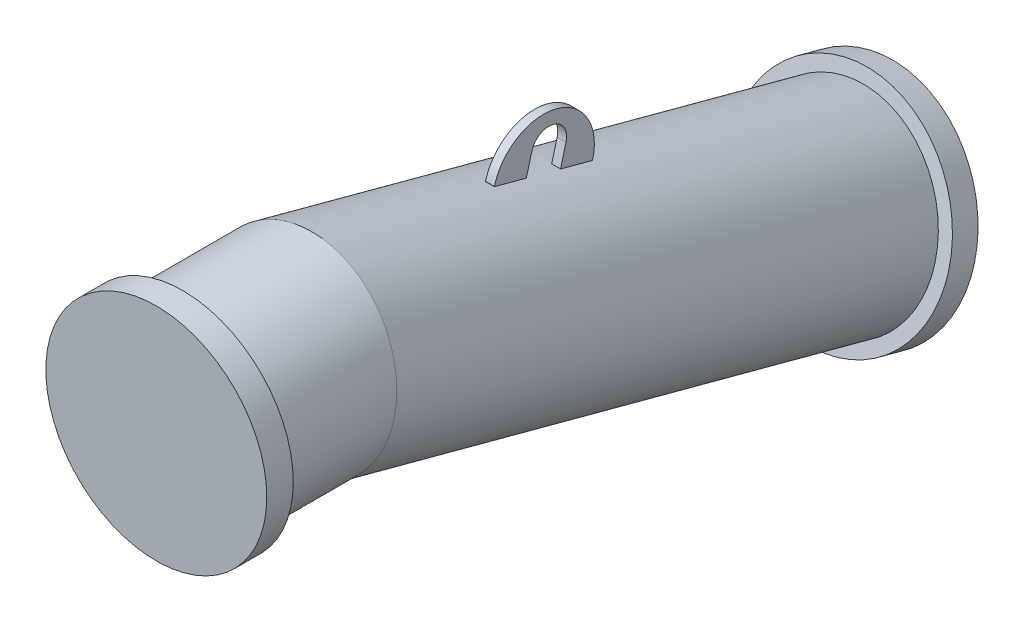
ISO-10303-21;
HEADER;
FILE_DESCRIPTION(('STEP AP214'),'2;1');
FILE_NAME('part.step','',(''),(''),'','','');
FILE_SCHEMA(('AUTOMOTIVE_DESIGN { 1 0 10303 214 1 1 1 1 }'));
ENDSEC;
DATA;
#1=APPLICATION_CONTEXT('core data for automotive mechanical design processes');
#2=APPLICATION_PROTOCOL_DEFINITION('international standard','automotive_design',2000,#1);
#3=PRODUCT_CONTEXT('',#1,'mechanical');
#4=PRODUCT('Part','Part','',(#3));
#5=PRODUCT_RELATED_PRODUCT_CATEGORY('part','',(#4));
#6=PRODUCT_DEFINITION_FORMATION('','',#4);
#7=PRODUCT_DEFINITION_CONTEXT('part definition',#1,'design');
#8=PRODUCT_DEFINITION('design','',#6,#7);
#9=PRODUCT_DEFINITION_SHAPE('','',#8);
#10=(LENGTH_UNIT() NAMED_UNIT(*) SI_UNIT(.MILLI.,.METRE.));
#11=(NAMED_UNIT(*) PLANE_ANGLE_UNIT() SI_UNIT($,.RADIAN.));
#12=(NAMED_UNIT(*) SI_UNIT($,.STERADIAN.) SOLID_ANGLE_UNIT());
#13=UNCERTAINTY_MEASURE_WITH_UNIT(LENGTH_MEASURE(1.E-05),#10,'distance_accuracy_value','');
#14=(GEOMETRIC_REPRESENTATION_CONTEXT(3) GLOBAL_UNCERTAINTY_ASSIGNED_CONTEXT((#13)) GLOBAL_UNIT_ASSIGNED_CONTEXT((#10,
#11,#12)) REPRESENTATION_CONTEXT('',''));
#15=CARTESIAN_POINT('',(0.,0.,0.));
#16=DIRECTION('',(0.,0.,1.));
#17=DIRECTION('',(1.,0.,0.));
#18=AXIS2_PLACEMENT_3D('',#15,#16,#17);
#19=CARTESIAN_POINT('',(5.00000000000018,63.8186386863556,-439.282486778395));
#20=DIRECTION('',(1.,0.,0.));
#21=DIRECTION('',(0.,0.965925826289068,-0.258819045102522));
#22=AXIS2_PLACEMENT_3D('',#19,#20,#21);
#23=PLANE('',#22);
#24=DIRECTION('',(0.,0.965925826289068,-0.258819045102522));
#25=VECTOR('',#24,1.);
#26=CARTESIAN_POINT('',(5.00000000000017,46.3422185990668,-375.071313755839));
#27=LINE('',#26,#25);
#28=CARTESIAN_POINT('',(5.00000000000017,55.4565376035607,-377.513488172653));
#29=VERTEX_POINT('',#28);
#30=CARTESIAN_POINT('',(5.00000000000017,56.0014768619576,-377.659504206864));
#31=VERTEX_POINT('',#30);
#32=EDGE_CURVE('E326',#29,#31,#27,.T.);
#33=ORIENTED_EDGE('',*,*,#32,.F.);
#34=DIRECTION('',(0.,-0.25881904510252,-0.965925826289062));
#35=VECTOR('',#34,1.);
#36=CARTESIAN_POINT('',(5.00000000000017,-23.7026209178614,-672.939489658995));
#37=LINE('',#36,#35);
#38=CARTESIAN_POINT('',(5.00000000000017,45.7508234122149,-413.735706658495));
#39=VERTEX_POINT('',#38);
#40=EDGE_CURVE('E51',#29,#39,#37,.T.);
#41=ORIENTED_EDGE('',*,*,#40,.T.);
#42=DIRECTION('',(0.,0.965925826289069,-0.258819045102522));
#43=VECTOR('',#42,1.);
#44=CARTESIAN_POINT('',(5.00000000000018,46.2957626706128,-413.881722692705));
#45=LINE('',#44,#43);
#46=CARTESIAN_POINT('',(5.00000000000018,68.995019588406,-419.963970252614));
#47=VERTEX_POINT('',#46);
#48=EDGE_CURVE('E333',#39,#47,#45,.T.);
#49=ORIENTED_EDGE('',*,*,#48,.T.);
#50=CARTESIAN_POINT('',(5.00000000000018,63.8186386863556,-439.282486778395));
#51=DIRECTION('',(-1.,0.,0.));
#52=DIRECTION('',(0.,0.965925826289068,-0.258819045102522));
#53=AXIS2_PLACEMENT_3D('',#50,#51,#52);
#54=CIRCLE('',#53,20.);
#55=CARTESIAN_POINT('',(5.00000000000017,58.6422577843051,-458.601003304177));
#56=VERTEX_POINT('',#55);
#57=EDGE_CURVE('E336',#47,#56,#54,.T.);
#58=ORIENTED_EDGE('',*,*,#57,.T.);
#59=DIRECTION('',(0.,-0.965925826289068,0.258819045102521));
#60=VECTOR('',#59,1.);
#61=CARTESIAN_POINT('',(5.00000000000017,35.9430008665119,-452.518755744267));
#62=LINE('',#61,#60);
#63=CARTESIAN_POINT('',(5.00000000000017,35.3980616081141,-452.372739710057));
#64=VERTEX_POINT('',#63);
#65=EDGE_CURVE('E340',#56,#64,#62,.T.);
#66=ORIENTED_EDGE('',*,*,#65,.T.);
#67=CARTESIAN_POINT('',(5.00000000000017,25.6923474167706,-488.594958195896));
#68=VERTEX_POINT('',#67);
#69=EDGE_CURVE('E305',#64,#68,#37,.T.);
#70=ORIENTED_EDGE('',*,*,#69,.T.);
#71=DIRECTION('',(0.,0.965925826289068,-0.258819045102522));
#72=VECTOR('',#71,1.);
#73=CARTESIAN_POINT('',(5.00000000000017,16.5780284122767,-486.152783779082));
#74=LINE('',#73,#72);
#75=CARTESIAN_POINT('',(5.00000000000018,26.2372866751674,-488.740974230107));
#76=VERTEX_POINT('',#75);
#77=EDGE_CURVE('E320',#68,#76,#74,.T.);
#78=ORIENTED_EDGE('',*,*,#77,.T.);
#79=CARTESIAN_POINT('',(5.00000000000017,41.1193817685624,-433.200239218486));
#80=DIRECTION('',(1.,0.,0.));
#81=DIRECTION('',(0.,0.965925826289068,-0.258819045102522));
#82=AXIS2_PLACEMENT_3D('',#79,#80,#81);
#83=CIRCLE('',#82,57.5);
#84=EDGE_CURVE('E343',#76,#31,#83,.T.);
#85=ORIENTED_EDGE('',*,*,#84,.T.);
#86=EDGE_LOOP('',(#33,#41,#49,#58,#66,#70,#78,#85));
#87=FACE_BOUND('',#86,.T.);
#88=ADVANCED_FACE('F17',(#87),#23,.T.);
#89=CARTESIAN_POINT('',(-4.99999999999982,63.8186386863556,-439.282486778395));
#90=DIRECTION('',(1.,0.,0.));
#91=DIRECTION('',(0.,0.965925826289068,-0.258819045102522));
#92=AXIS2_PLACEMENT_3D('',#89,#90,#91);
#93=PLANE('',#92);
#94=DIRECTION('',(0.,-0.25881904510252,-0.965925826289062));
#95=VECTOR('',#94,1.);
#96=CARTESIAN_POINT('',(-4.99999999999983,-23.7026209178614,-672.939489658995));
#97=LINE('',#96,#95);
#98=CARTESIAN_POINT('',(-4.99999999999983,55.4565376035607,-377.513488172653));
#99=VERTEX_POINT('',#98);
#100=CARTESIAN_POINT('',(-4.99999999999983,45.7508234122149,-413.735706658495));
#101=VERTEX_POINT('',#100);
#102=EDGE_CURVE('E306',#99,#101,#97,.T.);
#103=ORIENTED_EDGE('',*,*,#102,.F.);
#104=DIRECTION('',(0.,0.965925826289068,-0.258819045102522));
#105=VECTOR('',#104,1.);
#106=CARTESIAN_POINT('',(-4.99999999999983,46.3422185990668,-375.071313755839));
#107=LINE('',#106,#105);
#108=CARTESIAN_POINT('',(-4.99999999999983,56.0014768619576,-377.659504206864));
#109=VERTEX_POINT('',#108);
#110=EDGE_CURVE('E329',#99,#109,#107,.T.);
#111=ORIENTED_EDGE('',*,*,#110,.T.);
#112=CARTESIAN_POINT('',(-4.99999999999983,41.1193817685624,-433.200239218486));
#113=DIRECTION('',(1.,0.,0.));
#114=DIRECTION('',(0.,0.965925826289068,-0.258819045102522));
#115=AXIS2_PLACEMENT_3D('',#112,#113,#114);
#116=CIRCLE('',#115,57.5);
#117=CARTESIAN_POINT('',(-4.99999999999983,26.2372866751674,-488.740974230108));
#118=VERTEX_POINT('',#117);
#119=EDGE_CURVE('E337',#118,#109,#116,.T.);
#120=ORIENTED_EDGE('',*,*,#119,.F.);
#121=DIRECTION('',(0.,0.965925826289068,-0.258819045102522));
#122=VECTOR('',#121,1.);
#123=CARTESIAN_POINT('',(-4.99999999999983,16.5780284122767,-486.152783779082));
#124=LINE('',#123,#122);
#125=CARTESIAN_POINT('',(-4.99999999999983,25.6923474167706,-488.594958195896));
#126=VERTEX_POINT('',#125);
#127=EDGE_CURVE('E323',#126,#118,#124,.T.);
#128=ORIENTED_EDGE('',*,*,#127,.F.);
#129=CARTESIAN_POINT('',(-4.99999999999984,35.3980616081141,-452.372739710057));
#130=VERTEX_POINT('',#129);
#131=EDGE_CURVE('E290',#130,#126,#97,.T.);
#132=ORIENTED_EDGE('',*,*,#131,.F.);
#133=DIRECTION('',(0.,-0.965925826289068,0.258819045102521));
#134=VECTOR('',#133,1.);
#135=CARTESIAN_POINT('',(-4.99999999999983,35.9430008665119,-452.518755744267));
#136=LINE('',#135,#134);
#137=CARTESIAN_POINT('',(-4.99999999999983,58.6422577843051,-458.601003304177));
#138=VERTEX_POINT('',#137);
#139=EDGE_CURVE('E353',#138,#130,#136,.T.);
#140=ORIENTED_EDGE('',*,*,#139,.F.);
#141=CARTESIAN_POINT('',(-4.99999999999982,63.8186386863556,-439.282486778395));
#142=DIRECTION('',(-1.,0.,0.));
#143=DIRECTION('',(0.,0.965925826289068,-0.258819045102522));
#144=AXIS2_PLACEMENT_3D('',#141,#142,#143);
#145=CIRCLE('',#144,20.);
#146=CARTESIAN_POINT('',(-4.99999999999982,68.995019588406,-419.963970252614));
#147=VERTEX_POINT('',#146);
#148=EDGE_CURVE('E350',#147,#138,#145,.T.);
#149=ORIENTED_EDGE('',*,*,#148,.F.);
#150=DIRECTION('',(0.,0.965925826289069,-0.258819045102522));
#151=VECTOR('',#150,1.);
#152=CARTESIAN_POINT('',(-4.99999999999982,46.2957626706128,-413.881722692705));
#153=LINE('',#152,#151);
#154=EDGE_CURVE('E332',#101,#147,#153,.T.);
#155=ORIENTED_EDGE('',*,*,#154,.F.);
#156=EDGE_LOOP('',(#103,#111,#120,#128,#132,#140,#149,#155));
#157=FACE_BOUND('',#156,.T.);
#158=ADVANCED_FACE('F384',(#157),#93,.F.);
#159=CARTESIAN_POINT('',(5.00000000000018,46.2957626706128,-413.881722692705));
#160=DIRECTION('',(0.,0.258819045102522,0.965925826289069));
#161=DIRECTION('',(0.,-0.965925826289069,0.258819045102522));
#162=AXIS2_PLACEMENT_3D('',#159,#160,#161);
#163=PLANE('',#162);
#164=CARTESIAN_POINT('',(0.,-59.9560782211842,-385.411627731428));
#165=DIRECTION('',(0.,0.258819045102522,0.965925826289069));
#166=DIRECTION('',(0.,-0.965925826289068,0.258819045102522));
#167=AXIS2_PLACEMENT_3D('',#164,#165,#166);
#168=CIRCLE('',#167,109.55);
#169=EDGE_CURVE('E316',#101,#39,#168,.F.);
#170=ORIENTED_EDGE('',*,*,#169,.F.);
#171=ORIENTED_EDGE('',*,*,#154,.T.);
#172=DIRECTION('',(-1.,0.,0.));
#173=VECTOR('',#172,1.);
#174=CARTESIAN_POINT('',(5.00000000000018,68.995019588406,-419.963970252614));
#175=LINE('',#174,#173);
#176=EDGE_CURVE('E27',#47,#147,#175,.T.);
#177=ORIENTED_EDGE('',*,*,#176,.F.);
#178=ORIENTED_EDGE('',*,*,#48,.F.);
#179=EDGE_LOOP('',(#170,#171,#177,#178));
#180=FACE_BOUND('',#179,.T.);
#181=ADVANCED_FACE('F19',(#180),#163,.F.);
#182=CARTESIAN_POINT('',(5.00000000000018,63.8186386863556,-439.282486778395));
#183=DIRECTION('',(-1.,0.,0.));
#184=DIRECTION('',(0.,-0.965925826289068,0.258819045102522));
#185=AXIS2_PLACEMENT_3D('',#182,#183,#184);
#186=CYLINDRICAL_SURFACE('',#185,20.);
#187=ORIENTED_EDGE('',*,*,#148,.T.);
#188=DIRECTION('',(-1.,0.,0.));
#189=VECTOR('',#188,1.);
#190=CARTESIAN_POINT('',(5.00000000000017,58.6422577843051,-458.601003304177));
#191=LINE('',#190,#189);
#192=EDGE_CURVE('E366',#56,#138,#191,.T.);
#193=ORIENTED_EDGE('',*,*,#192,.F.);
#194=ORIENTED_EDGE('',*,*,#57,.F.);
#195=ORIENTED_EDGE('',*,*,#176,.T.);
#196=EDGE_LOOP('',(#187,#193,#194,#195));
#197=FACE_BOUND('',#196,.T.);
#198=ADVANCED_FACE('F377',(#197),#186,.F.);
#199=CARTESIAN_POINT('',(5.00000000000017,35.9430008665119,-452.518755744267));
#200=DIRECTION('',(0.,-0.258819045102521,-0.965925826289068));
#201=DIRECTION('',(0.,0.965925826289068,-0.258819045102521));
#202=AXIS2_PLACEMENT_3D('',#199,#200,#201);
#203=PLANE('',#202);
#204=CARTESIAN_POINT('',(0.,-70.308840025285,-424.04866078299));
#205=DIRECTION('',(0.,-0.258819045102521,-0.965925826289068));
#206=DIRECTION('',(0.,0.965925826289068,-0.258819045102521));
#207=AXIS2_PLACEMENT_3D('',#204,#205,#206);
#208=CIRCLE('',#207,109.55);
#209=EDGE_CURVE('E39',#64,#130,#208,.F.);
#210=ORIENTED_EDGE('',*,*,#209,.F.);
#211=ORIENTED_EDGE('',*,*,#65,.F.);
#212=ORIENTED_EDGE('',*,*,#192,.T.);
#213=ORIENTED_EDGE('',*,*,#139,.T.);
#214=EDGE_LOOP('',(#210,#211,#212,#213));
#215=FACE_BOUND('',#214,.T.);
#216=ADVANCED_FACE('F387',(#215),#203,.F.);
#217=CARTESIAN_POINT('',(5.00000000000017,41.1193817685624,-433.200239218486));
#218=DIRECTION('',(-1.,0.,0.));
#219=DIRECTION('',(0.,-0.965925826289068,0.258819045102522));
#220=AXIS2_PLACEMENT_3D('',#217,#218,#219);
#221=CYLINDRICAL_SURFACE('',#220,57.5);
#222=ORIENTED_EDGE('',*,*,#119,.T.);
#223=DIRECTION('',(-1.,0.,0.));
#224=VECTOR('',#223,1.);
#225=CARTESIAN_POINT('',(5.00000000000017,56.0014768619576,-377.659504206864));
#226=LINE('',#225,#224);
#227=EDGE_CURVE('E347',#31,#109,#226,.T.);
#228=ORIENTED_EDGE('',*,*,#227,.F.);
#229=ORIENTED_EDGE('',*,*,#84,.F.);
#230=DIRECTION('',(-1.,0.,0.));
#231=VECTOR('',#230,1.);
#232=CARTESIAN_POINT('',(5.00000000000018,26.2372866751674,-488.740974230107));
#233=LINE('',#232,#231);
#234=EDGE_CURVE('E362',#76,#118,#233,.T.);
#235=ORIENTED_EDGE('',*,*,#234,.T.);
#236=EDGE_LOOP('',(#222,#228,#229,#235));
#237=FACE_BOUND('',#236,.T.);
#238=ADVANCED_FACE('F483',(#237),#221,.T.);
#239=CARTESIAN_POINT('',(5.00000000000017,46.3422185990668,-375.071313755839));
#240=DIRECTION('',(0.,-0.258819045102522,-0.965925826289068));
#241=DIRECTION('',(0.,0.965925826289068,-0.258819045102522));
#242=AXIS2_PLACEMENT_3D('',#239,#240,#241);
#243=PLANE('',#242);
#244=CARTESIAN_POINT('',(0.,-50.2503640298395,-349.189409245587));
#245=DIRECTION('',(0.,-0.258819045102522,-0.965925826289068));
#246=DIRECTION('',(0.,0.965925826289068,-0.258819045102522));
#247=AXIS2_PLACEMENT_3D('',#244,#245,#246);
#248=CIRCLE('',#247,109.55);
#249=EDGE_CURVE('E312',#29,#99,#248,.F.);
#250=ORIENTED_EDGE('',*,*,#249,.F.);
#251=ORIENTED_EDGE('',*,*,#32,.T.);
#252=ORIENTED_EDGE('',*,*,#227,.T.);
#253=ORIENTED_EDGE('',*,*,#110,.F.);
#254=EDGE_LOOP('',(#250,#251,#252,#253));
#255=FACE_BOUND('',#254,.T.);
#256=ADVANCED_FACE('F499',(#255),#243,.F.);
#257=CARTESIAN_POINT('',(-4.99999999999983,16.5780284122767,-486.152783779082));
#258=DIRECTION('',(0.,0.258819045102522,0.965925826289068));
#259=DIRECTION('',(0.,-0.965925826289068,0.258819045102522));
#260=AXIS2_PLACEMENT_3D('',#257,#258,#259);
#261=PLANE('',#260);
#262=CARTESIAN_POINT('',(0.,-80.0145542166296,-460.27087926883));
#263=DIRECTION('',(0.,0.258819045102522,0.965925826289068));
#264=DIRECTION('',(0.,-0.965925826289068,0.258819045102522));
#265=AXIS2_PLACEMENT_3D('',#262,#263,#264);
#266=CIRCLE('',#265,109.55);
#267=EDGE_CURVE('E10',#126,#68,#266,.F.);
#268=ORIENTED_EDGE('',*,*,#267,.F.);
#269=ORIENTED_EDGE('',*,*,#127,.T.);
#270=ORIENTED_EDGE('',*,*,#234,.F.);
#271=ORIENTED_EDGE('',*,*,#77,.F.);
#272=EDGE_LOOP('',(#268,#269,#270,#271));
#273=FACE_BOUND('',#272,.T.);
#274=ADVANCED_FACE('F507',(#273),#261,.F.);
#275=CARTESIAN_POINT('',(0.,-129.409522551261,-644.61541073193));
#276=DIRECTION('',(0.,-0.25881904510252,-0.965925826289062));
#277=DIRECTION('',(-1.,0.,0.));
#278=AXIS2_PLACEMENT_3D('',#275,#276,#277);
#279=CYLINDRICAL_SURFACE('',#278,109.55);
#280=CARTESIAN_POINT('',(0.,-163.483696262192,-771.781958247055));
#281=DIRECTION('',(0.,0.25881904510252,0.965925826289062));
#282=DIRECTION('',(1.,0.,0.));
#283=AXIS2_PLACEMENT_3D('',#280,#281,#282);
#284=CIRCLE('',#283,109.55);
#285=CARTESIAN_POINT('',(109.55,-163.483696262192,-771.781958247055));
#286=VERTEX_POINT('',#285);
#287=EDGE_CURVE('E278',#286,#286,#284,.T.);
#288=ORIENTED_EDGE('',*,*,#287,.T.);
#289=EDGE_LOOP('',(#288));
#290=FACE_BOUND('',#289,.T.);
#291=CARTESIAN_POINT('',(0.,0.,-161.652497587396));
#292=DIRECTION('',(0.,-0.130526192220052,-0.99144486137381));
#293=DIRECTION('',(0.,-0.99144486137381,0.130526192220052));
#294=AXIS2_PLACEMENT_3D('',#291,#292,#293);
#295=ELLIPSE('',#294,110.495302631556,109.55);
#296=CARTESIAN_POINT('',(0.,-109.55,-147.229966476697));
#297=VERTEX_POINT('',#296);
#298=EDGE_CURVE('E285',#297,#297,#295,.T.);
#299=ORIENTED_EDGE('',*,*,#298,.T.);
#300=EDGE_LOOP('',(#299));
#301=FACE_BOUND('',#300,.T.);
#302=ORIENTED_EDGE('',*,*,#69,.F.);
#303=ORIENTED_EDGE('',*,*,#209,.T.);
#304=ORIENTED_EDGE('',*,*,#131,.T.);
#305=ORIENTED_EDGE('',*,*,#267,.T.);
#306=EDGE_LOOP('',(#302,#303,#304,#305));
#307=FACE_BOUND('',#306,.T.);
#308=ORIENTED_EDGE('',*,*,#102,.T.);
#309=ORIENTED_EDGE('',*,*,#169,.T.);
#310=ORIENTED_EDGE('',*,*,#40,.F.);
#311=ORIENTED_EDGE('',*,*,#249,.T.);
#312=EDGE_LOOP('',(#308,#309,#310,#311));
#313=FACE_BOUND('',#312,.T.);
#314=ADVANCED_FACE('F390',(#290,#301,#307,#313),#279,.T.);
#315=CARTESIAN_POINT('',(0.,0.,-30.));
#316=DIRECTION('',(0.,0.,1.));
#317=DIRECTION('',(1.,0.,0.));
#318=AXIS2_PLACEMENT_3D('',#315,#316,#317);
#319=CYLINDRICAL_SURFACE('',#318,125.);
#320=CARTESIAN_POINT('',(0.,0.,-30.));
#321=DIRECTION('',(0.,0.,1.));
#322=DIRECTION('',(1.,0.,0.));
#323=AXIS2_PLACEMENT_3D('',#320,#321,#322);
#324=CIRCLE('',#323,125.);
#325=CARTESIAN_POINT('',(125.,-1.15452967920071E-13,-30.));
#326=VERTEX_POINT('',#325);
#327=EDGE_CURVE('E291',#326,#326,#324,.T.);
#328=ORIENTED_EDGE('',*,*,#327,.T.);
#329=EDGE_LOOP('',(#328));
#330=FACE_BOUND('',#329,.T.);
#331=CARTESIAN_POINT('',(0.,0.,0.));
#332=DIRECTION('',(0.,0.,1.));
#333=DIRECTION('',(1.,0.,0.));
#334=AXIS2_PLACEMENT_3D('',#331,#332,#333);
#335=CIRCLE('',#334,125.);
#336=CARTESIAN_POINT('',(125.,0.,0.));
#337=VERTEX_POINT('',#336);
#338=EDGE_CURVE('E295',#337,#337,#335,.T.);
#339=ORIENTED_EDGE('',*,*,#338,.F.);
#340=EDGE_LOOP('',(#339));
#341=FACE_BOUND('',#340,.T.);
#342=ADVANCED_FACE('F524',(#330,#341),#319,.T.);
#343=CARTESIAN_POINT('',(0.,0.,-30.));
#344=DIRECTION('',(0.,0.,1.));
#345=DIRECTION('',(1.,0.,0.));
#346=AXIS2_PLACEMENT_3D('',#343,#344,#345);
#347=PLANE('',#346);
#348=CARTESIAN_POINT('',(0.,0.,-30.));
#349=DIRECTION('',(0.,0.,-1.));
#350=DIRECTION('',(-1.,0.,0.));
#351=AXIS2_PLACEMENT_3D('',#348,#349,#350);
#352=CIRCLE('',#351,109.55);
#353=CARTESIAN_POINT('',(-109.55,0.,-30.));
#354=VERTEX_POINT('',#353);
#355=EDGE_CURVE('E286',#354,#354,#352,.T.);
#356=ORIENTED_EDGE('',*,*,#355,.F.);
#357=EDGE_LOOP('',(#356));
#358=FACE_BOUND('',#357,.T.);
#359=ORIENTED_EDGE('',*,*,#327,.F.);
#360=EDGE_LOOP('',(#359));
#361=FACE_BOUND('',#360,.T.);
#362=ADVANCED_FACE('F533',(#358,#361),#347,.F.);
#363=CARTESIAN_POINT('',(0.,0.,-161.652497587396));
#364=DIRECTION('',(0.,0.,1.));
#365=DIRECTION('',(1.,0.,0.));
#366=AXIS2_PLACEMENT_3D('',#363,#364,#365);
#367=CYLINDRICAL_SURFACE('',#366,109.55);
#368=ORIENTED_EDGE('',*,*,#355,.T.);
#369=EDGE_LOOP('',(#368));
#370=FACE_BOUND('',#369,.T.);
#371=ORIENTED_EDGE('',*,*,#298,.F.);
#372=EDGE_LOOP('',(#371));
#373=FACE_BOUND('',#372,.T.);
#374=ADVANCED_FACE('F542',(#370,#373),#367,.T.);
#375=CARTESIAN_POINT('',(-2.18629213052836E-13,-163.483696262189,-771.781958247055));
#376=DIRECTION('',(0.,-0.258819045102521,-0.965925826289068));
#377=DIRECTION('',(1.,0.,0.));
#378=AXIS2_PLACEMENT_3D('',#375,#376,#377);
#379=CYLINDRICAL_SURFACE('',#378,125.);
#380=CARTESIAN_POINT('',(-2.18629213052836E-13,-163.483696262189,-771.781958247055));
#381=DIRECTION('',(0.,-0.258819045102521,-0.965925826289068));
#382=DIRECTION('',(1.,0.,0.));
#383=AXIS2_PLACEMENT_3D('',#380,#381,#382);
#384=CIRCLE('',#383,125.);
#385=CARTESIAN_POINT('',(125.,-163.483696262189,-771.781958247055));
#386=VERTEX_POINT('',#385);
#387=EDGE_CURVE('E274',#386,#386,#384,.T.);
#388=ORIENTED_EDGE('',*,*,#387,.T.);
#389=EDGE_LOOP('',(#388));
#390=FACE_BOUND('',#389,.T.);
#391=CARTESIAN_POINT('',(-2.18063372837271E-13,-171.248267615265,-800.759733035727));
#392=DIRECTION('',(0.,-0.258819045102521,-0.965925826289068));
#393=DIRECTION('',(1.,0.,0.));
#394=AXIS2_PLACEMENT_3D('',#391,#392,#393);
#395=CIRCLE('',#394,125.);
#396=CARTESIAN_POINT('',(125.,-171.248267615265,-800.759733035727));
#397=VERTEX_POINT('',#396);
#398=EDGE_CURVE('E270',#397,#397,#395,.T.);
#399=ORIENTED_EDGE('',*,*,#398,.F.);
#400=EDGE_LOOP('',(#399));
#401=FACE_BOUND('',#400,.T.);
#402=ADVANCED_FACE('F470',(#390,#401),#379,.T.);
#403=CARTESIAN_POINT('',(-2.18629213052836E-13,-163.483696262189,-771.781958247055));
#404=DIRECTION('',(0.,-0.258819045102521,-0.965925826289068));
#405=DIRECTION('',(1.,0.,0.));
#406=AXIS2_PLACEMENT_3D('',#403,#404,#405);
#407=PLANE('',#406);
#408=ORIENTED_EDGE('',*,*,#287,.F.);
#409=EDGE_LOOP('',(#408));
#410=FACE_BOUND('',#409,.T.);
#411=ORIENTED_EDGE('',*,*,#387,.F.);
#412=EDGE_LOOP('',(#411));
#413=FACE_BOUND('',#412,.T.);
#414=ADVANCED_FACE('F464',(#410,#413),#407,.F.);
#415=CARTESIAN_POINT('',(0.,0.,0.));
#416=DIRECTION('',(0.,0.,1.));
#417=DIRECTION('',(1.,0.,0.));
#418=AXIS2_PLACEMENT_3D('',#415,#416,#417);
#419=PLANE('',#418);
#420=ORIENTED_EDGE('',*,*,#338,.T.);
#421=EDGE_LOOP('',(#420));
#422=FACE_BOUND('',#421,.T.);
#423=ADVANCED_FACE('F469',(#422),#419,.T.);
#424=CARTESIAN_POINT('',(-2.18063372837271E-13,-171.248267615265,-800.759733035727));
#425=DIRECTION('',(0.,-0.258819045102521,-0.965925826289068));
#426=DIRECTION('',(1.,0.,0.));
#427=AXIS2_PLACEMENT_3D('',#424,#425,#426);
#428=PLANE('',#427);
#429=ORIENTED_EDGE('',*,*,#398,.T.);
#430=EDGE_LOOP('',(#429));
#431=FACE_BOUND('',#430,.T.);
#432=ADVANCED_FACE('F1164',(#431),#428,.T.);
#433=CLOSED_SHELL('',(#88,#158,#181,#198,#216,#238,#256,#274,#314,#342,#362,#374,#402,#414,#423,#432));
#434=CARTESIAN_POINT('',(0.,0.,-30.));
#435=DIRECTION('',(0.,0.,1.));
#436=DIRECTION('',(1.,0.,0.));
#437=AXIS2_PLACEMENT_3D('',#434,#435,#436);
#438=PLANE('',#437);
#439=CARTESIAN_POINT('',(0.,0.,-30.));
#440=DIRECTION('',(0.,0.,1.));
#441=DIRECTION('',(1.,0.,0.));
#442=AXIS2_PLACEMENT_3D('',#439,#440,#441);
#443=CIRCLE('',#442,62.5);
#444=CARTESIAN_POINT('',(62.5,0.,-30.));
#445=VERTEX_POINT('',#444);
#446=EDGE_CURVE('E207',#445,#445,#443,.T.);
#447=ORIENTED_EDGE('',*,*,#446,.T.);
#448=EDGE_LOOP('',(#447));
#449=FACE_BOUND('',#448,.T.);
#450=CARTESIAN_POINT('',(0.,0.,-30.));
#451=DIRECTION('',(0.,0.,-1.));
#452=DIRECTION('',(0.,1.,0.));
#453=AXIS2_PLACEMENT_3D('',#450,#451,#452);
#454=CIRCLE('',#453,63.5);
#455=CARTESIAN_POINT('',(0.,63.4999999999952,-30.0000000000001));
#456=VERTEX_POINT('',#455);
#457=EDGE_CURVE('E265',#456,#456,#454,.T.);
#458=ORIENTED_EDGE('',*,*,#457,.T.);
#459=EDGE_LOOP('',(#458));
#460=FACE_BOUND('',#459,.T.);
#461=ADVANCED_FACE('F1148',(#449,#460),#438,.F.);
#462=CARTESIAN_POINT('',(1.02574340395525E-13,-1000.,-29.9999999999995));
#463=DIRECTION('',(-1.,0.,0.));
#464=DIRECTION('',(0.,0.,1.));
#465=AXIS2_PLACEMENT_3D('',#462,#463,#464);
#466=TOROIDAL_SURFACE('',#465,1000.,63.5);
#467=CARTESIAN_POINT('',(0.,-34.0741737109315,-288.819045102521));
#468=DIRECTION('',(0.,0.258819045102522,0.965925826289067));
#469=DIRECTION('',(0.999999999999999,0.,0.));
#470=AXIS2_PLACEMENT_3D('',#467,#468,#469);
#471=CIRCLE('',#470,63.5);
#472=CARTESIAN_POINT('',(0.,27.2621162584195,-305.25405446653));
#473=VERTEX_POINT('',#472);
#474=EDGE_CURVE('E261',#473,#473,#471,.T.);
#475=CARTESIAN_POINT('',(1.02574340395525E-13,-1000.,-29.9999999999995));
#476=DIRECTION('',(-1.,0.,0.));
#477=DIRECTION('',(0.,0.,1.));
#478=AXIS2_PLACEMENT_3D('',#475,#476,#477);
#479=CIRCLE('',#478,1063.5);
#480=EDGE_CURVE('',#456,#473,#479,.T.);
#481=ORIENTED_EDGE('',*,*,#457,.F.);
#482=ORIENTED_EDGE('',*,*,#474,.F.);
#483=ORIENTED_EDGE('',*,*,#480,.T.);
#484=ORIENTED_EDGE('',*,*,#480,.F.);
#485=EDGE_LOOP('',(#481,#483,#482,#484));
#486=FACE_BOUND('',#485,.T.);
#487=ADVANCED_FACE('F1136',(#486),#466,.F.);
#488=CARTESIAN_POINT('',(0.,-34.0741737109315,-288.819045102521));
#489=DIRECTION('',(0.,-0.258819045102522,-0.965925826289067));
#490=DIRECTION('',(-0.999999999999999,0.,0.));
#491=AXIS2_PLACEMENT_3D('',#488,#489,#490);
#492=CYLINDRICAL_SURFACE('',#491,63.5);
#493=ORIENTED_EDGE('',*,*,#474,.T.);
#494=EDGE_LOOP('',(#493));
#495=FACE_BOUND('',#494,.T.);
#496=CARTESIAN_POINT('',(0.,-163.483696262193,-771.781958247054));
#497=DIRECTION('',(0.,0.258819045102522,0.965925826289067));
#498=DIRECTION('',(0.999999999999999,0.,0.));
#499=AXIS2_PLACEMENT_3D('',#496,#497,#498);
#500=CIRCLE('',#499,63.5);
#501=CARTESIAN_POINT('',(63.5,-163.483696262193,-771.781958247054));
#502=VERTEX_POINT('',#501);
#503=EDGE_CURVE('E266',#502,#502,#500,.T.);
#504=ORIENTED_EDGE('',*,*,#503,.F.);
#505=EDGE_LOOP('',(#504));
#506=FACE_BOUND('',#505,.T.);
#507=ADVANCED_FACE('F1122',(#495,#506),#492,.F.);
#508=CARTESIAN_POINT('',(-2.18629213052836E-13,-163.483696262189,-771.781958247055));
#509=DIRECTION('',(0.,-0.258819045102521,-0.965925826289068));
#510=DIRECTION('',(1.,0.,0.));
#511=AXIS2_PLACEMENT_3D('',#508,#509,#510);
#512=PLANE('',#511);
#513=CARTESIAN_POINT('',(-2.18629213052836E-13,-163.483696262189,-771.781958247055));
#514=DIRECTION('',(0.,-0.258819045102521,-0.965925826289068));
#515=DIRECTION('',(1.,0.,0.));
#516=AXIS2_PLACEMENT_3D('',#513,#514,#515);
#517=CIRCLE('',#516,62.5);
#518=CARTESIAN_POINT('',(62.4999999999998,-163.483696262189,-771.781958247055));
#519=VERTEX_POINT('',#518);
#520=EDGE_CURVE('E715',#519,#519,#517,.T.);
#521=ORIENTED_EDGE('',*,*,#520,.T.);
#522=EDGE_LOOP('',(#521));
#523=FACE_BOUND('',#522,.T.);
#524=ORIENTED_EDGE('',*,*,#503,.T.);
#525=EDGE_LOOP('',(#524));
#526=FACE_BOUND('',#525,.T.);
#527=ADVANCED_FACE('F1109',(#523,#526),#512,.F.);
#528=CARTESIAN_POINT('',(-2.18629213052836E-13,-163.483696262189,-771.781958247055));
#529=DIRECTION('',(0.,-0.258819045102521,-0.965925826289068));
#530=DIRECTION('',(1.,0.,0.));
#531=AXIS2_PLACEMENT_3D('',#528,#529,#530);
#532=CYLINDRICAL_SURFACE('',#531,62.5);
#533=ORIENTED_EDGE('',*,*,#520,.F.);
#534=EDGE_LOOP('',(#533));
#535=FACE_BOUND('',#534,.T.);
#536=CARTESIAN_POINT('',(-2.18534906350242E-13,-164.777791487702,-776.611587378501));
#537=DIRECTION('',(0.,-0.258819045102521,-0.965925826289068));
#538=DIRECTION('',(0.,0.965925826289068,-0.258819045102521));
#539=AXIS2_PLACEMENT_3D('',#536,#537,#538);
#540=CIRCLE('',#539,62.5);
#541=CARTESIAN_POINT('',(-2.18534906350242E-13,-104.407427344635,-792.787777697408));
#542=VERTEX_POINT('',#541);
#543=EDGE_CURVE('E200',#542,#542,#540,.F.);
#544=ORIENTED_EDGE('',*,*,#543,.F.);
#545=EDGE_LOOP('',(#544));
#546=FACE_BOUND('',#545,.T.);
#547=ADVANCED_FACE('F1098',(#535,#546),#532,.F.);
#548=CARTESIAN_POINT('',(-2.18534906350242E-13,-164.777791487702,-776.611587378501));
#549=DIRECTION('',(0.,-0.258819045102521,-0.965925826289068));
#550=DIRECTION('',(0.,0.965925826289068,-0.258819045102521));
#551=AXIS2_PLACEMENT_3D('',#548,#549,#550);
#552=PLANE('',#551);
#553=ORIENTED_EDGE('',*,*,#543,.T.);
#554=EDGE_LOOP('',(#553));
#555=FACE_BOUND('',#554,.T.);
#556=ADVANCED_FACE('F732',(#555),#552,.F.);
#557=CARTESIAN_POINT('',(0.,0.,-25.));
#558=DIRECTION('',(0.,0.,1.));
#559=DIRECTION('',(1.,0.,0.));
#560=AXIS2_PLACEMENT_3D('',#557,#558,#559);
#561=PLANE('',#560);
#562=CARTESIAN_POINT('',(0.,0.,-25.));
#563=DIRECTION('',(0.,0.,1.));
#564=DIRECTION('',(1.,0.,0.));
#565=AXIS2_PLACEMENT_3D('',#562,#563,#564);
#566=CIRCLE('',#565,62.5);
#567=CARTESIAN_POINT('',(62.5,0.,-25.));
#568=VERTEX_POINT('',#567);
#569=EDGE_CURVE('E206',#568,#568,#566,.F.);
#570=ORIENTED_EDGE('',*,*,#569,.T.);
#571=EDGE_LOOP('',(#570));
#572=FACE_BOUND('',#571,.T.);
#573=ADVANCED_FACE('F1074',(#572),#561,.F.);
#574=CARTESIAN_POINT('',(0.,0.,-30.));
#575=DIRECTION('',(0.,0.,1.));
#576=DIRECTION('',(1.,0.,0.));
#577=AXIS2_PLACEMENT_3D('',#574,#575,#576);
#578=CYLINDRICAL_SURFACE('',#577,62.5);
#579=ORIENTED_EDGE('',*,*,#446,.F.);
#580=EDGE_LOOP('',(#579));
#581=FACE_BOUND('',#580,.T.);
#582=ORIENTED_EDGE('',*,*,#569,.F.);
#583=EDGE_LOOP('',(#582));
#584=FACE_BOUND('',#583,.T.);
#585=ADVANCED_FACE('F561',(#581,#584),#578,.F.);
#586=CLOSED_SHELL('',(#461,#487,#507,#527,#547,#556,#573,#585));
#587=CARTESIAN_POINT('',(-40.1817603983344,-71.3347049453892,-802.684863136194));
#588=DIRECTION('',(0.,-0.258819045102521,-0.965925826289068));
#589=DIRECTION('',(0.,0.965925826289068,-0.258819045102521));
#590=AXIS2_PLACEMENT_3D('',#587,#588,#589);
#591=PLANE('',#590);
#592=CARTESIAN_POINT('',(-40.1817603983344,-71.3347049453892,-802.684863136194));
#593=DIRECTION('',(0.,-0.258819045102521,-0.965925826289068));
#594=DIRECTION('',(1.,0.,0.));
#595=AXIS2_PLACEMENT_3D('',#592,#593,#594);
#596=CIRCLE('',#595,6.99999999999999);
#597=CARTESIAN_POINT('',(-33.1817603983344,-71.3347049453892,-802.684863136194));
#598=VERTEX_POINT('',#597);
#599=EDGE_CURVE('E214',#598,#598,#596,.T.);
#600=ORIENTED_EDGE('',*,*,#599,.F.);
#601=EDGE_LOOP('',(#600));
#602=FACE_BOUND('',#601,.T.);
#603=ADVANCED_FACE('F447',(#602),#591,.F.);
#604=CARTESIAN_POINT('',(-40.1817603983344,-71.3347049453892,-802.684863136194));
#605=DIRECTION('',(0.,-0.258819045102521,-0.965925826289068));
#606=DIRECTION('',(1.,0.,0.));
#607=AXIS2_PLACEMENT_3D('',#604,#605,#606);
#608=CONICAL_SURFACE('',#607,6.99999999999999,1.02974425867665);
#609=CARTESIAN_POINT('',(-40.1817603983344,-70.2461057437942,-798.622155606762));
#610=VERTEX_POINT('',#609);
#611=VERTEX_LOOP('',#610);
#612=FACE_BOUND('',#611,.T.);
#613=ORIENTED_EDGE('',*,*,#599,.T.);
#614=EDGE_LOOP('',(#613));
#615=FACE_BOUND('',#614,.T.);
#616=ADVANCED_FACE('F452',(#612,#615),#608,.F.);
#617=CLOSED_SHELL('',(#603,#616));
#618=CARTESIAN_POINT('',(40.1817603983346,-71.3347049453896,-802.684863136194));
#619=DIRECTION('',(0.,-0.258819045102521,-0.965925826289068));
#620=DIRECTION('',(0.,0.965925826289068,-0.258819045102521));
#621=AXIS2_PLACEMENT_3D('',#618,#619,#620);
#622=PLANE('',#621);
#623=CARTESIAN_POINT('',(40.1817603983346,-71.3347049453896,-802.684863136194));
#624=DIRECTION('',(0.,-0.258819045102521,-0.965925826289068));
#625=DIRECTION('',(1.,0.,0.));
#626=AXIS2_PLACEMENT_3D('',#623,#624,#625);
#627=CIRCLE('',#626,6.99999999999999);
#628=CARTESIAN_POINT('',(47.1817603983346,-71.3347049453896,-802.684863136194));
#629=VERTEX_POINT('',#628);
#630=EDGE_CURVE('E219',#629,#629,#627,.T.);
#631=ORIENTED_EDGE('',*,*,#630,.F.);
#632=EDGE_LOOP('',(#631));
#633=FACE_BOUND('',#632,.T.);
#634=ADVANCED_FACE('F1043',(#633),#622,.F.);
#635=CARTESIAN_POINT('',(40.1817603983346,-71.3347049453896,-802.684863136194));
#636=DIRECTION('',(0.,-0.258819045102521,-0.965925826289068));
#637=DIRECTION('',(1.,0.,0.));
#638=AXIS2_PLACEMENT_3D('',#635,#636,#637);
#639=CONICAL_SURFACE('',#638,6.99999999999999,1.02974425867665);
#640=CARTESIAN_POINT('',(40.1817603983346,-70.2461057437948,-798.622155606763));
#641=VERTEX_POINT('',#640);
#642=VERTEX_LOOP('',#641);
#643=FACE_BOUND('',#642,.T.);
#644=ORIENTED_EDGE('',*,*,#630,.T.);
#645=EDGE_LOOP('',(#644));
#646=FACE_BOUND('',#645,.T.);
#647=ADVANCED_FACE('F1038',(#643,#646),#639,.F.);
#648=CLOSED_SHELL('',(#634,#647));
#649=CARTESIAN_POINT('',(97.0073509136851,-126.224010418294,-787.977318061624));
#650=DIRECTION('',(0.,-0.258819045102521,-0.965925826289068));
#651=DIRECTION('',(0.,0.965925826289068,-0.258819045102521));
#652=AXIS2_PLACEMENT_3D('',#649,#650,#651);
#653=PLANE('',#652);
#654=CARTESIAN_POINT('',(97.0073509136851,-126.224010418294,-787.977318061624));
#655=DIRECTION('',(0.,-0.258819045102521,-0.965925826289068));
#656=DIRECTION('',(1.,0.,0.));
#657=AXIS2_PLACEMENT_3D('',#654,#655,#656);
#658=CIRCLE('',#657,6.99999999999999);
#659=CARTESIAN_POINT('',(104.007350913685,-126.224010418294,-787.977318061624));
#660=VERTEX_POINT('',#659);
#661=EDGE_CURVE('E193',#660,#660,#658,.T.);
#662=ORIENTED_EDGE('',*,*,#661,.F.);
#663=EDGE_LOOP('',(#662));
#664=FACE_BOUND('',#663,.T.);
#665=ADVANCED_FACE('F1019',(#664),#653,.F.);
#666=CARTESIAN_POINT('',(97.0073509136851,-126.224010418294,-787.977318061624));
#667=DIRECTION('',(0.,-0.258819045102521,-0.965925826289068));
#668=DIRECTION('',(1.,0.,0.));
#669=AXIS2_PLACEMENT_3D('',#666,#667,#668);
#670=CONICAL_SURFACE('',#669,6.99999999999999,1.02974425867665);
#671=CARTESIAN_POINT('',(97.0073509136851,-125.135411216699,-783.914610532193));
#672=VERTEX_POINT('',#671);
#673=VERTEX_LOOP('',#672);
#674=FACE_BOUND('',#673,.T.);
#675=ORIENTED_EDGE('',*,*,#661,.T.);
#676=EDGE_LOOP('',(#675));
#677=FACE_BOUND('',#676,.T.);
#678=ADVANCED_FACE('F1014',(#674,#677),#670,.F.);
#679=CLOSED_SHELL('',(#665,#678));
#680=CARTESIAN_POINT('',(97.0073509136846,-203.849210647315,-767.177708347953));
#681=DIRECTION('',(0.,-0.258819045102521,-0.965925826289068));
#682=DIRECTION('',(0.,0.965925826289068,-0.258819045102521));
#683=AXIS2_PLACEMENT_3D('',#680,#681,#682);
#684=PLANE('',#683);
#685=CARTESIAN_POINT('',(97.0073509136846,-203.849210647315,-767.177708347953));
#686=DIRECTION('',(0.,-0.258819045102521,-0.965925826289068));
#687=DIRECTION('',(1.,0.,0.));
#688=AXIS2_PLACEMENT_3D('',#685,#686,#687);
#689=CIRCLE('',#688,6.99999999999999);
#690=CARTESIAN_POINT('',(104.007350913685,-203.849210647315,-767.177708347953));
#691=VERTEX_POINT('',#690);
#692=EDGE_CURVE('E184',#691,#691,#689,.T.);
#693=ORIENTED_EDGE('',*,*,#692,.F.);
#694=EDGE_LOOP('',(#693));
#695=FACE_BOUND('',#694,.T.);
#696=ADVANCED_FACE('F995',(#695),#684,.F.);
#697=CARTESIAN_POINT('',(97.0073509136846,-203.849210647315,-767.177708347953));
#698=DIRECTION('',(0.,-0.258819045102521,-0.965925826289068));
#699=DIRECTION('',(1.,0.,0.));
#700=AXIS2_PLACEMENT_3D('',#697,#698,#699);
#701=CONICAL_SURFACE('',#700,6.99999999999999,1.02974425867665);
#702=CARTESIAN_POINT('',(97.0073509136846,-202.76061144572,-763.115000818522));
#703=VERTEX_POINT('',#702);
#704=VERTEX_LOOP('',#703);
#705=FACE_BOUND('',#704,.T.);
#706=ORIENTED_EDGE('',*,*,#692,.T.);
#707=EDGE_LOOP('',(#706));
#708=FACE_BOUND('',#707,.T.);
#709=ADVANCED_FACE('F990',(#705,#708),#701,.F.);
#710=CLOSED_SHELL('',(#696,#709));
#711=CARTESIAN_POINT('',(40.1817603983333,-258.738516120219,-752.470163273384));
#712=DIRECTION('',(0.,-0.258819045102521,-0.965925826289068));
#713=DIRECTION('',(0.,0.965925826289068,-0.258819045102521));
#714=AXIS2_PLACEMENT_3D('',#711,#712,#713);
#715=PLANE('',#714);
#716=CARTESIAN_POINT('',(40.1817603983333,-258.738516120219,-752.470163273384));
#717=DIRECTION('',(0.,-0.258819045102521,-0.965925826289068));
#718=DIRECTION('',(1.,0.,0.));
#719=AXIS2_PLACEMENT_3D('',#716,#717,#718);
#720=CIRCLE('',#719,6.99999999999999);
#721=CARTESIAN_POINT('',(47.1817603983333,-258.738516120219,-752.470163273384));
#722=VERTEX_POINT('',#721);
#723=EDGE_CURVE('E181',#722,#722,#720,.T.);
#724=ORIENTED_EDGE('',*,*,#723,.F.);
#725=EDGE_LOOP('',(#724));
#726=FACE_BOUND('',#725,.T.);
#727=ADVANCED_FACE('F175',(#726),#715,.F.);
#728=CARTESIAN_POINT('',(40.1817603983333,-258.738516120219,-752.470163273384));
#729=DIRECTION('',(0.,-0.258819045102521,-0.965925826289068));
#730=DIRECTION('',(1.,0.,0.));
#731=AXIS2_PLACEMENT_3D('',#728,#729,#730);
#732=CONICAL_SURFACE('',#731,6.99999999999999,1.02974425867665);
#733=CARTESIAN_POINT('',(40.1817603983333,-257.649916918624,-748.407455743953));
#734=VERTEX_POINT('',#733);
#735=VERTEX_LOOP('',#734);
#736=FACE_BOUND('',#735,.T.);
#737=ORIENTED_EDGE('',*,*,#723,.T.);
#738=EDGE_LOOP('',(#737));
#739=FACE_BOUND('',#738,.T.);
#740=ADVANCED_FACE('F172',(#736,#739),#732,.F.);
#741=CLOSED_SHELL('',(#727,#740));
#742=CARTESIAN_POINT('',(-40.1817603983357,-258.738516120219,-752.470163273384));
#743=DIRECTION('',(0.,-0.258819045102521,-0.965925826289068));
#744=DIRECTION('',(0.,0.965925826289068,-0.258819045102521));
#745=AXIS2_PLACEMENT_3D('',#742,#743,#744);
#746=PLANE('',#745);
#747=CARTESIAN_POINT('',(-40.1817603983357,-258.738516120219,-752.470163273384));
#748=DIRECTION('',(0.,-0.258819045102521,-0.965925826289068));
#749=DIRECTION('',(1.,0.,0.));
#750=AXIS2_PLACEMENT_3D('',#747,#748,#749);
#751=CIRCLE('',#750,6.99999999999999);
#752=CARTESIAN_POINT('',(-33.1817603983357,-258.738516120219,-752.470163273384));
#753=VERTEX_POINT('',#752);
#754=EDGE_CURVE('E185',#753,#753,#751,.T.);
#755=ORIENTED_EDGE('',*,*,#754,.F.);
#756=EDGE_LOOP('',(#755));
#757=FACE_BOUND('',#756,.T.);
#758=ADVANCED_FACE('F429',(#757),#746,.F.);
#759=CARTESIAN_POINT('',(-40.1817603983357,-258.738516120219,-752.470163273384));
#760=DIRECTION('',(0.,-0.258819045102521,-0.965925826289068));
#761=DIRECTION('',(1.,0.,0.));
#762=AXIS2_PLACEMENT_3D('',#759,#760,#761);
#763=CONICAL_SURFACE('',#762,6.99999999999999,1.02974425867665);
#764=CARTESIAN_POINT('',(-40.1817603983357,-257.649916918623,-748.407455743953));
#765=VERTEX_POINT('',#764);
#766=VERTEX_LOOP('',#765);
#767=FACE_BOUND('',#766,.T.);
#768=ORIENTED_EDGE('',*,*,#754,.T.);
#769=EDGE_LOOP('',(#768));
#770=FACE_BOUND('',#769,.T.);
#771=ADVANCED_FACE('F425',(#767,#770),#763,.F.);
#772=CLOSED_SHELL('',(#758,#771));
#773=CARTESIAN_POINT('',(-97.0073509136858,-203.849210647313,-767.177708347954));
#774=DIRECTION('',(0.,-0.258819045102521,-0.965925826289068));
#775=DIRECTION('',(0.,0.965925826289068,-0.258819045102521));
#776=AXIS2_PLACEMENT_3D('',#773,#774,#775);
#777=PLANE('',#776);
#778=CARTESIAN_POINT('',(-97.0073509136858,-203.849210647313,-767.177708347954));
#779=DIRECTION('',(0.,-0.258819045102521,-0.965925826289068));
#780=DIRECTION('',(1.,0.,0.));
#781=AXIS2_PLACEMENT_3D('',#778,#779,#780);
#782=CIRCLE('',#781,6.99999999999999);
#783=CARTESIAN_POINT('',(-90.0073509136859,-203.849210647313,-767.177708347954));
#784=VERTEX_POINT('',#783);
#785=EDGE_CURVE('E197',#784,#784,#782,.T.);
#786=ORIENTED_EDGE('',*,*,#785,.F.);
#787=EDGE_LOOP('',(#786));
#788=FACE_BOUND('',#787,.T.);
#789=ADVANCED_FACE('F948',(#788),#777,.F.);
#790=CARTESIAN_POINT('',(-97.0073509136858,-203.849210647313,-767.177708347954));
#791=DIRECTION('',(0.,-0.258819045102521,-0.965925826289068));
#792=DIRECTION('',(1.,0.,0.));
#793=AXIS2_PLACEMENT_3D('',#790,#791,#792);
#794=CONICAL_SURFACE('',#793,6.99999999999999,1.02974425867665);
#795=CARTESIAN_POINT('',(-97.0073509136858,-202.760611445718,-763.115000818523));
#796=VERTEX_POINT('',#795);
#797=VERTEX_LOOP('',#796);
#798=FACE_BOUND('',#797,.T.);
#799=ORIENTED_EDGE('',*,*,#785,.T.);
#800=EDGE_LOOP('',(#799));
#801=FACE_BOUND('',#800,.T.);
#802=ADVANCED_FACE('F943',(#798,#801),#794,.F.);
#803=CLOSED_SHELL('',(#789,#802));
#804=CARTESIAN_POINT('',(-40.1817603983342,-97.0073509136853,-24.0000000000007));
#805=DIRECTION('',(0.,0.,1.));
#806=DIRECTION('',(0.,-1.,0.));
#807=AXIS2_PLACEMENT_3D('',#804,#805,#806);
#808=PLANE('',#807);
#809=CARTESIAN_POINT('',(-40.1817603983342,-97.0073509136853,-24.0000000000007));
#810=DIRECTION('',(0.,0.,1.));
#811=DIRECTION('',(1.,0.,0.));
#812=AXIS2_PLACEMENT_3D('',#809,#810,#811);
#813=CIRCLE('',#812,6.99999999999999);
#814=CARTESIAN_POINT('',(-33.1817603983342,-97.0073509136853,-24.0000000000007));
#815=VERTEX_POINT('',#814);
#816=EDGE_CURVE('E242',#815,#815,#813,.T.);
#817=ORIENTED_EDGE('',*,*,#816,.F.);
#818=EDGE_LOOP('',(#817));
#819=FACE_BOUND('',#818,.T.);
#820=ADVANCED_FACE('F924',(#819),#808,.F.);
#821=CARTESIAN_POINT('',(-40.1817603983342,-97.0073509136853,-24.0000000000007));
#822=DIRECTION('',(0.,0.,1.));
#823=DIRECTION('',(1.,0.,0.));
#824=AXIS2_PLACEMENT_3D('',#821,#822,#823);
#825=CONICAL_SURFACE('',#824,6.99999999999999,1.02974425867665);
#826=CARTESIAN_POINT('',(-40.1817603983342,-97.0073509136854,-28.2060243331936));
#827=VERTEX_POINT('',#826);
#828=VERTEX_LOOP('',#827);
#829=FACE_BOUND('',#828,.T.);
#830=ORIENTED_EDGE('',*,*,#816,.T.);
#831=EDGE_LOOP('',(#830));
#832=FACE_BOUND('',#831,.T.);
#833=ADVANCED_FACE('F919',(#829,#832),#825,.F.);
#834=CLOSED_SHELL('',(#820,#833));
#835=CARTESIAN_POINT('',(40.1817603983348,-97.0073509136848,-24.0000000000007));
#836=DIRECTION('',(0.,0.,1.));
#837=DIRECTION('',(0.,-1.,0.));
#838=AXIS2_PLACEMENT_3D('',#835,#836,#837);
#839=PLANE('',#838);
#840=CARTESIAN_POINT('',(40.1817603983348,-97.0073509136848,-24.0000000000007));
#841=DIRECTION('',(0.,0.,1.));
#842=DIRECTION('',(1.,0.,0.));
#843=AXIS2_PLACEMENT_3D('',#840,#841,#842);
#844=CIRCLE('',#843,6.99999999999999);
#845=CARTESIAN_POINT('',(47.1817603983348,-97.0073509136848,-24.0000000000007));
#846=VERTEX_POINT('',#845);
#847=EDGE_CURVE('E247',#846,#846,#844,.T.);
#848=ORIENTED_EDGE('',*,*,#847,.F.);
#849=EDGE_LOOP('',(#848));
#850=FACE_BOUND('',#849,.T.);
#851=ADVANCED_FACE('F901',(#850),#839,.F.);
#852=CARTESIAN_POINT('',(40.1817603983348,-97.0073509136848,-24.0000000000007));
#853=DIRECTION('',(0.,0.,1.));
#854=DIRECTION('',(1.,0.,0.));
#855=AXIS2_PLACEMENT_3D('',#852,#853,#854);
#856=CONICAL_SURFACE('',#855,6.99999999999999,1.02974425867665);
#857=CARTESIAN_POINT('',(40.1817603983348,-97.0073509136849,-28.206024333193));
#858=VERTEX_POINT('',#857);
#859=VERTEX_LOOP('',#858);
#860=FACE_BOUND('',#859,.T.);
#861=ORIENTED_EDGE('',*,*,#847,.T.);
#862=EDGE_LOOP('',(#861));
#863=FACE_BOUND('',#862,.T.);
#864=ADVANCED_FACE('F896',(#860,#863),#856,.F.);
#865=CLOSED_SHELL('',(#851,#864));
#866=CARTESIAN_POINT('',(97.0073509136853,-40.181760398334,-24.0000000000002));
#867=DIRECTION('',(0.,0.,1.));
#868=DIRECTION('',(0.,-1.,0.));
#869=AXIS2_PLACEMENT_3D('',#866,#867,#868);
#870=PLANE('',#869);
#871=CARTESIAN_POINT('',(97.0073509136853,-40.181760398334,-24.0000000000002));
#872=DIRECTION('',(0.,0.,1.));
#873=DIRECTION('',(1.,0.,0.));
#874=AXIS2_PLACEMENT_3D('',#871,#872,#873);
#875=CIRCLE('',#874,6.99999999999999);
#876=CARTESIAN_POINT('',(104.007350913685,-40.181760398334,-24.0000000000002));
#877=VERTEX_POINT('',#876);
#878=EDGE_CURVE('E251',#877,#877,#875,.T.);
#879=ORIENTED_EDGE('',*,*,#878,.F.);
#880=EDGE_LOOP('',(#879));
#881=FACE_BOUND('',#880,.T.);
#882=ADVANCED_FACE('F877',(#881),#870,.F.);
#883=CARTESIAN_POINT('',(97.0073509136853,-40.181760398334,-24.0000000000002));
#884=DIRECTION('',(0.,0.,1.));
#885=DIRECTION('',(1.,0.,0.));
#886=AXIS2_PLACEMENT_3D('',#883,#884,#885);
#887=CONICAL_SURFACE('',#886,6.99999999999999,1.02974425867665);
#888=CARTESIAN_POINT('',(97.0073509136853,-40.181760398334,-28.2060243331927));
#889=VERTEX_POINT('',#888);
#890=VERTEX_LOOP('',#889);
#891=FACE_BOUND('',#890,.T.);
#892=ORIENTED_EDGE('',*,*,#878,.T.);
#893=EDGE_LOOP('',(#892));
#894=FACE_BOUND('',#893,.T.);
#895=ADVANCED_FACE('F872',(#891,#894),#887,.F.);
#896=CLOSED_SHELL('',(#882,#895));
#897=CARTESIAN_POINT('',(97.0073509136848,40.1817603983347,-24.0000000000008));
#898=DIRECTION('',(0.,0.,1.));
#899=DIRECTION('',(0.,-1.,0.));
#900=AXIS2_PLACEMENT_3D('',#897,#898,#899);
#901=PLANE('',#900);
#902=CARTESIAN_POINT('',(97.0073509136848,40.1817603983347,-24.0000000000008));
#903=DIRECTION('',(0.,0.,1.));
#904=DIRECTION('',(1.,0.,0.));
#905=AXIS2_PLACEMENT_3D('',#902,#903,#904);
#906=CIRCLE('',#905,6.99999999999999);
#907=CARTESIAN_POINT('',(104.007350913685,40.1817603983347,-24.0000000000008));
#908=VERTEX_POINT('',#907);
#909=EDGE_CURVE('E230',#908,#908,#906,.T.);
#910=ORIENTED_EDGE('',*,*,#909,.F.);
#911=EDGE_LOOP('',(#910));
#912=FACE_BOUND('',#911,.T.);
#913=ADVANCED_FACE('F853',(#912),#901,.F.);
#914=CARTESIAN_POINT('',(97.0073509136848,40.1817603983347,-24.0000000000008));
#915=DIRECTION('',(0.,0.,1.));
#916=DIRECTION('',(1.,0.,0.));
#917=AXIS2_PLACEMENT_3D('',#914,#915,#916);
#918=CONICAL_SURFACE('',#917,6.99999999999999,1.02974425867665);
#919=CARTESIAN_POINT('',(97.0073509136848,40.1817603983346,-28.2060243331936));
#920=VERTEX_POINT('',#919);
#921=VERTEX_LOOP('',#920);
#922=FACE_BOUND('',#921,.T.);
#923=ORIENTED_EDGE('',*,*,#909,.T.);
#924=EDGE_LOOP('',(#923));
#925=FACE_BOUND('',#924,.T.);
#926=ADVANCED_FACE('F849',(#922,#925),#918,.F.);
#927=CLOSED_SHELL('',(#913,#926));
#928=CARTESIAN_POINT('',(40.1817603983335,97.007350913685,-24.));
#929=DIRECTION('',(0.,0.,1.));
#930=DIRECTION('',(0.,-1.,0.));
#931=AXIS2_PLACEMENT_3D('',#928,#929,#930);
#932=PLANE('',#931);
#933=CARTESIAN_POINT('',(40.1817603983335,97.007350913685,-24.));
#934=DIRECTION('',(0.,0.,1.));
#935=DIRECTION('',(1.,0.,0.));
#936=AXIS2_PLACEMENT_3D('',#933,#934,#935);
#937=CIRCLE('',#936,6.99999999999999);
#938=CARTESIAN_POINT('',(47.1817603983335,97.007350913685,-24.));
#939=VERTEX_POINT('',#938);
#940=EDGE_CURVE('E226',#939,#939,#937,.T.);
#941=ORIENTED_EDGE('',*,*,#940,.F.);
#942=EDGE_LOOP('',(#941));
#943=FACE_BOUND('',#942,.T.);
#944=ADVANCED_FACE('F406',(#943),#932,.F.);
#945=CARTESIAN_POINT('',(40.1817603983335,97.007350913685,-24.));
#946=DIRECTION('',(0.,0.,1.));
#947=DIRECTION('',(1.,0.,0.));
#948=AXIS2_PLACEMENT_3D('',#945,#946,#947);
#949=CONICAL_SURFACE('',#948,6.99999999999999,1.02974425867665);
#950=CARTESIAN_POINT('',(40.1817603983335,97.007350913685,-28.206024333193));
#951=VERTEX_POINT('',#950);
#952=VERTEX_LOOP('',#951);
#953=FACE_BOUND('',#952,.T.);
#954=ORIENTED_EDGE('',*,*,#940,.T.);
#955=EDGE_LOOP('',(#954));
#956=FACE_BOUND('',#955,.T.);
#957=ADVANCED_FACE('F411',(#953,#956),#949,.F.);
#958=CLOSED_SHELL('',(#944,#957));
#959=CARTESIAN_POINT('',(-40.1817603983355,97.0073509136844,-24.));
#960=DIRECTION('',(0.,0.,1.));
#961=DIRECTION('',(0.,-1.,0.));
#962=AXIS2_PLACEMENT_3D('',#959,#960,#961);
#963=PLANE('',#962);
#964=CARTESIAN_POINT('',(-40.1817603983355,97.0073509136844,-24.));
#965=DIRECTION('',(0.,0.,1.));
#966=DIRECTION('',(1.,0.,0.));
#967=AXIS2_PLACEMENT_3D('',#964,#965,#966);
#968=CIRCLE('',#967,6.99999999999999);
#969=CARTESIAN_POINT('',(-33.1817603983355,97.0073509136844,-24.));
#970=VERTEX_POINT('',#969);
#971=EDGE_CURVE('E231',#970,#970,#968,.T.);
#972=ORIENTED_EDGE('',*,*,#971,.F.);
#973=EDGE_LOOP('',(#972));
#974=FACE_BOUND('',#973,.T.);
#975=ADVANCED_FACE('F821',(#974),#963,.F.);
#976=CARTESIAN_POINT('',(-40.1817603983355,97.0073509136844,-24.));
#977=DIRECTION('',(0.,0.,1.));
#978=DIRECTION('',(1.,0.,0.));
#979=AXIS2_PLACEMENT_3D('',#976,#977,#978);
#980=CONICAL_SURFACE('',#979,6.99999999999999,1.02974425867665);
#981=CARTESIAN_POINT('',(-40.1817603983355,97.0073509136842,-28.2060243331932));
#982=VERTEX_POINT('',#981);
#983=VERTEX_LOOP('',#982);
#984=FACE_BOUND('',#983,.T.);
#985=ORIENTED_EDGE('',*,*,#971,.T.);
#986=EDGE_LOOP('',(#985));
#987=FACE_BOUND('',#986,.T.);
#988=ADVANCED_FACE('F816',(#984,#987),#980,.F.);
#989=CLOSED_SHELL('',(#975,#988));
#990=CARTESIAN_POINT('',(-97.0073509136856,40.1817603983328,-24.0000000000009));
#991=DIRECTION('',(0.,0.,1.));
#992=DIRECTION('',(0.,-1.,0.));
#993=AXIS2_PLACEMENT_3D('',#990,#991,#992);
#994=PLANE('',#993);
#995=CARTESIAN_POINT('',(-97.0073509136856,40.1817603983328,-24.0000000000009));
#996=DIRECTION('',(0.,0.,1.));
#997=DIRECTION('',(1.,0.,0.));
#998=AXIS2_PLACEMENT_3D('',#995,#996,#997);
#999=CIRCLE('',#998,6.99999999999999);
#1000=CARTESIAN_POINT('',(-90.0073509136856,40.1817603983328,-24.0000000000009));
#1001=VERTEX_POINT('',#1000);
#1002=EDGE_CURVE('E235',#1001,#1001,#999,.T.);
#1003=ORIENTED_EDGE('',*,*,#1002,.F.);
#1004=EDGE_LOOP('',(#1003));
#1005=FACE_BOUND('',#1004,.T.);
#1006=ADVANCED_FACE('F797',(#1005),#994,.F.);
#1007=CARTESIAN_POINT('',(-97.0073509136856,40.1817603983328,-24.0000000000009));
#1008=DIRECTION('',(0.,0.,1.));
#1009=DIRECTION('',(1.,0.,0.));
#1010=AXIS2_PLACEMENT_3D('',#1007,#1008,#1009);
#1011=CONICAL_SURFACE('',#1010,6.99999999999999,1.02974425867665);
#1012=CARTESIAN_POINT('',(-97.0073509136856,40.1817603983328,-28.2060243331936));
#1013=VERTEX_POINT('',#1012);
#1014=VERTEX_LOOP('',#1013);
#1015=FACE_BOUND('',#1014,.T.);
#1016=ORIENTED_EDGE('',*,*,#1002,.T.);
#1017=EDGE_LOOP('',(#1016));
#1018=FACE_BOUND('',#1017,.T.);
#1019=ADVANCED_FACE('F792',(#1015,#1018),#1011,.F.);
#1020=CLOSED_SHELL('',(#1006,#1019));
#1021=CARTESIAN_POINT('',(-97.0073509136854,-126.224010418294,-787.977318061624));
#1022=DIRECTION('',(0.,-0.258819045102521,-0.965925826289068));
#1023=DIRECTION('',(0.,0.965925826289068,-0.258819045102521));
#1024=AXIS2_PLACEMENT_3D('',#1021,#1022,#1023);
#1025=PLANE('',#1024);
#1026=CARTESIAN_POINT('',(-97.0073509136854,-126.224010418294,-787.977318061624));
#1027=DIRECTION('',(0.,-0.258819045102521,-0.965925826289068));
#1028=DIRECTION('',(1.,0.,0.));
#1029=AXIS2_PLACEMENT_3D('',#1026,#1027,#1028);
#1030=CIRCLE('',#1029,6.99999999999999);
#1031=CARTESIAN_POINT('',(-90.0073509136854,-126.224010418294,-787.977318061624));
#1032=VERTEX_POINT('',#1031);
#1033=EDGE_CURVE('E218',#1032,#1032,#1030,.T.);
#1034=ORIENTED_EDGE('',*,*,#1033,.F.);
#1035=EDGE_LOOP('',(#1034));
#1036=FACE_BOUND('',#1035,.T.);
#1037=ADVANCED_FACE('F773',(#1036),#1025,.F.);
#1038=CARTESIAN_POINT('',(-97.0073509136854,-126.224010418294,-787.977318061624));
#1039=DIRECTION('',(0.,-0.258819045102521,-0.965925826289068));
#1040=DIRECTION('',(1.,0.,0.));
#1041=AXIS2_PLACEMENT_3D('',#1038,#1039,#1040);
#1042=CONICAL_SURFACE('',#1041,6.99999999999999,1.02974425867665);
#1043=CARTESIAN_POINT('',(-97.0073509136854,-125.135411216699,-783.914610532193));
#1044=VERTEX_POINT('',#1043);
#1045=VERTEX_LOOP('',#1044);
#1046=FACE_BOUND('',#1045,.T.);
#1047=ORIENTED_EDGE('',*,*,#1033,.T.);
#1048=EDGE_LOOP('',(#1047));
#1049=FACE_BOUND('',#1048,.T.);
#1050=ADVANCED_FACE('F768',(#1046,#1049),#1042,.F.);
#1051=CLOSED_SHELL('',(#1037,#1050));
#1052=CARTESIAN_POINT('',(-97.0073509136851,-40.1817603983346,-24.0000000000001));
#1053=DIRECTION('',(0.,0.,1.));
#1054=DIRECTION('',(0.,-1.,0.));
#1055=AXIS2_PLACEMENT_3D('',#1052,#1053,#1054);
#1056=PLANE('',#1055);
#1057=CARTESIAN_POINT('',(-97.0073509136851,-40.1817603983346,-24.0000000000001));
#1058=DIRECTION('',(0.,0.,1.));
#1059=DIRECTION('',(1.,0.,0.));
#1060=AXIS2_PLACEMENT_3D('',#1057,#1058,#1059);
#1061=CIRCLE('',#1060,6.99999999999999);
#1062=CARTESIAN_POINT('',(-90.0073509136852,-40.1817603983346,-24.0000000000001));
#1063=VERTEX_POINT('',#1062);
#1064=EDGE_CURVE('E246',#1063,#1063,#1061,.T.);
#1065=ORIENTED_EDGE('',*,*,#1064,.F.);
#1066=EDGE_LOOP('',(#1065));
#1067=FACE_BOUND('',#1066,.T.);
#1068=ADVANCED_FACE('F743',(#1067),#1056,.F.);
#1069=CARTESIAN_POINT('',(-97.0073509136851,-40.1817603983346,-24.0000000000001));
#1070=DIRECTION('',(0.,0.,1.));
#1071=DIRECTION('',(1.,0.,0.));
#1072=AXIS2_PLACEMENT_3D('',#1069,#1070,#1071);
#1073=CONICAL_SURFACE('',#1072,6.99999999999999,1.02974425867665);
#1074=CARTESIAN_POINT('',(-97.0073509136851,-40.1817603983345,-28.206024333193));
#1075=VERTEX_POINT('',#1074);
#1076=VERTEX_LOOP('',#1075);
#1077=FACE_BOUND('',#1076,.T.);
#1078=ORIENTED_EDGE('',*,*,#1064,.T.);
#1079=EDGE_LOOP('',(#1078));
#1080=FACE_BOUND('',#1079,.T.);
#1081=ADVANCED_FACE('F738',(#1077,#1080),#1073,.F.);
#1082=CLOSED_SHELL('',(#1068,#1081));
#1083=ORIENTED_CLOSED_SHELL('',*,#586,.T.);
#1084=ORIENTED_CLOSED_SHELL('',*,#617,.T.);
#1085=ORIENTED_CLOSED_SHELL('',*,#648,.T.);
#1086=ORIENTED_CLOSED_SHELL('',*,#679,.T.);
#1087=ORIENTED_CLOSED_SHELL('',*,#710,.T.);
#1088=ORIENTED_CLOSED_SHELL('',*,#741,.T.);
#1089=ORIENTED_CLOSED_SHELL('',*,#772,.T.);
#1090=ORIENTED_CLOSED_SHELL('',*,#803,.T.);
#1091=ORIENTED_CLOSED_SHELL('',*,#834,.T.);
#1092=ORIENTED_CLOSED_SHELL('',*,#865,.T.);
#1093=ORIENTED_CLOSED_SHELL('',*,#896,.T.);
#1094=ORIENTED_CLOSED_SHELL('',*,#927,.T.);
#1095=ORIENTED_CLOSED_SHELL('',*,#958,.T.);
#1096=ORIENTED_CLOSED_SHELL('',*,#989,.T.);
#1097=ORIENTED_CLOSED_SHELL('',*,#1020,.T.);
#1098=ORIENTED_CLOSED_SHELL('',*,#1051,.T.);
#1099=ORIENTED_CLOSED_SHELL('',*,#1082,.T.);
#1100=BREP_WITH_VOIDS('B1',#433,(#1083,#1084,#1085,#1086,#1087,#1088,#1089,#1090,#1091,#1092,
#1093,#1094,#1095,#1096,#1097,#1098,#1099));
#1101=ADVANCED_BREP_SHAPE_REPRESENTATION('',(#18,#1100),#14);
#1102=SHAPE_DEFINITION_REPRESENTATION(#9,#1101);
ENDSEC;
END-ISO-10303-21;
